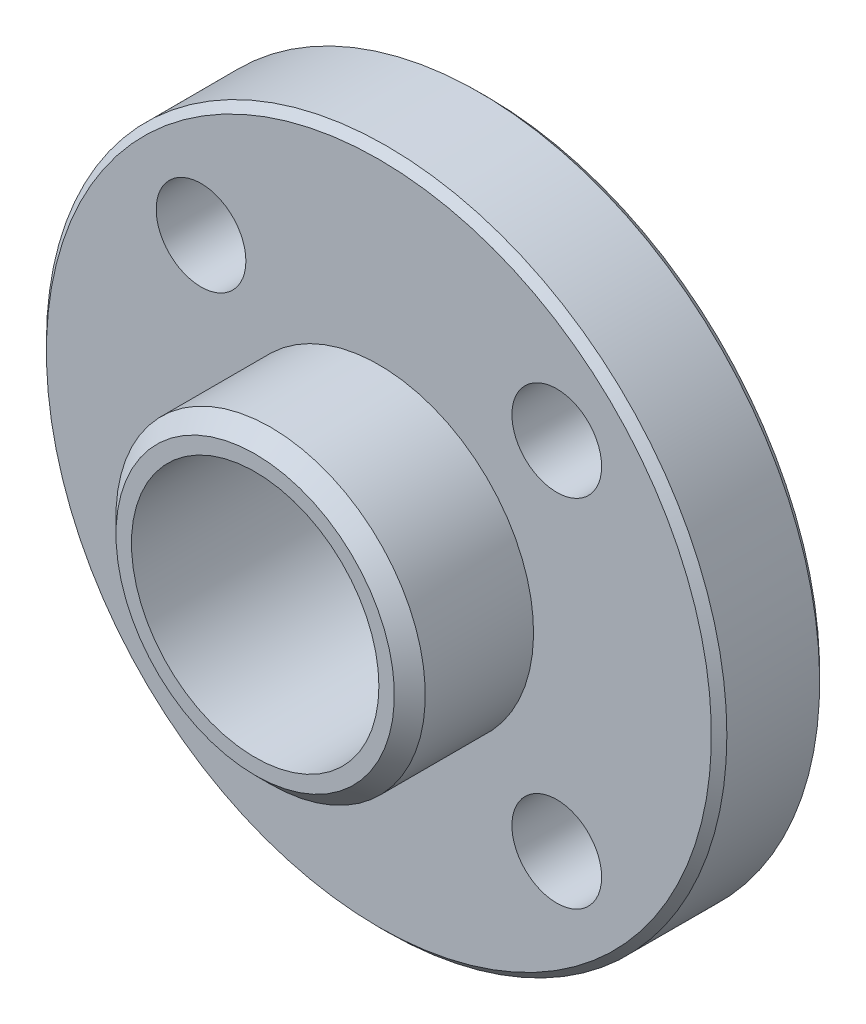
ISO-10303-21;
HEADER;
FILE_DESCRIPTION(('STEP AP214'),'2;1');
FILE_NAME('part.step','',(''),(''),'','','');
FILE_SCHEMA(('AUTOMOTIVE_DESIGN { 1 0 10303 214 1 1 1 1 }'));
ENDSEC;
DATA;
#1=APPLICATION_CONTEXT('core data for automotive mechanical design processes');
#2=APPLICATION_PROTOCOL_DEFINITION('international standard','automotive_design',2000,#1);
#3=PRODUCT_CONTEXT('',#1,'mechanical');
#4=PRODUCT('Part','Part','',(#3));
#5=PRODUCT_RELATED_PRODUCT_CATEGORY('part','',(#4));
#6=PRODUCT_DEFINITION_FORMATION('','',#4);
#7=PRODUCT_DEFINITION_CONTEXT('part definition',#1,'design');
#8=PRODUCT_DEFINITION('design','',#6,#7);
#9=PRODUCT_DEFINITION_SHAPE('','',#8);
#10=(LENGTH_UNIT() NAMED_UNIT(*) SI_UNIT(.MILLI.,.METRE.));
#11=(NAMED_UNIT(*) PLANE_ANGLE_UNIT() SI_UNIT($,.RADIAN.));
#12=(NAMED_UNIT(*) SI_UNIT($,.STERADIAN.) SOLID_ANGLE_UNIT());
#13=UNCERTAINTY_MEASURE_WITH_UNIT(LENGTH_MEASURE(1.E-05),#10,'distance_accuracy_value','');
#14=(GEOMETRIC_REPRESENTATION_CONTEXT(3) GLOBAL_UNCERTAINTY_ASSIGNED_CONTEXT((#13)) GLOBAL_UNIT_ASSIGNED_CONTEXT((#10,
#11,#12)) REPRESENTATION_CONTEXT('',''));
#15=CARTESIAN_POINT('',(0.,0.,0.));
#16=DIRECTION('',(0.,0.,1.));
#17=DIRECTION('',(1.,0.,0.));
#18=AXIS2_PLACEMENT_3D('',#15,#16,#17);
#19=CARTESIAN_POINT('',(0.,0.,5.75));
#20=DIRECTION('',(0.,0.,-1.));
#21=DIRECTION('',(0.,1.,0.));
#22=AXIS2_PLACEMENT_3D('',#19,#20,#21);
#23=PLANE('',#22);
#24=CARTESIAN_POINT('',(0.,0.,5.75));
#25=DIRECTION('',(0.,0.,-1.));
#26=DIRECTION('',(0.,1.,0.));
#27=AXIS2_PLACEMENT_3D('',#24,#25,#26);
#28=CIRCLE('',#27,4.5);
#29=CARTESIAN_POINT('',(0.,4.5,5.75));
#30=VERTEX_POINT('',#29);
#31=EDGE_CURVE('E95',#30,#30,#28,.F.);
#32=ORIENTED_EDGE('',*,*,#31,.T.);
#33=EDGE_LOOP('',(#32));
#34=FACE_BOUND('',#33,.T.);
#35=CARTESIAN_POINT('',(0.,0.,5.75));
#36=DIRECTION('',(0.,0.,1.));
#37=DIRECTION('',(1.,0.,0.));
#38=AXIS2_PLACEMENT_3D('',#35,#36,#37);
#39=CIRCLE('',#38,4.);
#40=CARTESIAN_POINT('',(4.,0.,5.75));
#41=VERTEX_POINT('',#40);
#42=EDGE_CURVE('E77',#41,#41,#39,.T.);
#43=ORIENTED_EDGE('',*,*,#42,.F.);
#44=EDGE_LOOP('',(#43));
#45=FACE_BOUND('',#44,.T.);
#46=ADVANCED_FACE('F36',(#34,#45),#23,.F.);
#47=CARTESIAN_POINT('',(0.,0.,5.75));
#48=DIRECTION('',(0.,0.,1.));
#49=DIRECTION('',(0.,-1.,0.));
#50=AXIS2_PLACEMENT_3D('',#47,#48,#49);
#51=CYLINDRICAL_SURFACE('',#50,5.);
#52=CARTESIAN_POINT('',(0.,0.,5.25));
#53=DIRECTION('',(0.,0.,-1.));
#54=DIRECTION('',(0.,1.,0.));
#55=AXIS2_PLACEMENT_3D('',#52,#53,#54);
#56=CIRCLE('',#55,5.);
#57=CARTESIAN_POINT('',(0.,5.,5.25));
#58=VERTEX_POINT('',#57);
#59=EDGE_CURVE('E98',#58,#58,#56,.T.);
#60=ORIENTED_EDGE('',*,*,#59,.T.);
#61=EDGE_LOOP('',(#60));
#62=FACE_BOUND('',#61,.T.);
#63=CARTESIAN_POINT('',(0.,0.,1.75));
#64=DIRECTION('',(0.,0.,1.));
#65=DIRECTION('',(0.,-1.,0.));
#66=AXIS2_PLACEMENT_3D('',#63,#64,#65);
#67=CIRCLE('',#66,5.);
#68=CARTESIAN_POINT('',(0.,-5.,1.75));
#69=VERTEX_POINT('',#68);
#70=EDGE_CURVE('E86',#69,#69,#67,.T.);
#71=ORIENTED_EDGE('',*,*,#70,.T.);
#72=EDGE_LOOP('',(#71));
#73=FACE_BOUND('',#72,.T.);
#74=ADVANCED_FACE('F122',(#62,#73),#51,.T.);
#75=CARTESIAN_POINT('',(0.,5.,1.75));
#76=DIRECTION('',(0.,0.,-1.));
#77=DIRECTION('',(0.,1.,0.));
#78=AXIS2_PLACEMENT_3D('',#75,#76,#77);
#79=PLANE('',#78);
#80=CARTESIAN_POINT('',(-5.75,5.75,1.75));
#81=DIRECTION('',(0.,0.,1.));
#82=DIRECTION('',(1.,0.,0.));
#83=AXIS2_PLACEMENT_3D('',#80,#81,#82);
#84=CIRCLE('',#83,1.45);
#85=CARTESIAN_POINT('',(-4.3,5.75,1.75));
#86=VERTEX_POINT('',#85);
#87=EDGE_CURVE('E69',#86,#86,#84,.T.);
#88=ORIENTED_EDGE('',*,*,#87,.F.);
#89=EDGE_LOOP('',(#88));
#90=FACE_BOUND('',#89,.T.);
#91=CARTESIAN_POINT('',(5.75,5.75,1.75));
#92=DIRECTION('',(0.,0.,1.));
#93=DIRECTION('',(1.,0.,0.));
#94=AXIS2_PLACEMENT_3D('',#91,#92,#93);
#95=CIRCLE('',#94,1.45);
#96=CARTESIAN_POINT('',(7.2,5.75,1.75));
#97=VERTEX_POINT('',#96);
#98=EDGE_CURVE('E59',#97,#97,#95,.T.);
#99=ORIENTED_EDGE('',*,*,#98,.F.);
#100=EDGE_LOOP('',(#99));
#101=FACE_BOUND('',#100,.T.);
#102=CARTESIAN_POINT('',(5.75,-5.75,1.75));
#103=DIRECTION('',(0.,0.,1.));
#104=DIRECTION('',(1.,0.,0.));
#105=AXIS2_PLACEMENT_3D('',#102,#103,#104);
#106=CIRCLE('',#105,1.45);
#107=CARTESIAN_POINT('',(7.2,-5.75,1.75));
#108=VERTEX_POINT('',#107);
#109=EDGE_CURVE('E56',#108,#108,#106,.T.);
#110=ORIENTED_EDGE('',*,*,#109,.F.);
#111=EDGE_LOOP('',(#110));
#112=FACE_BOUND('',#111,.T.);
#113=CARTESIAN_POINT('',(-5.75,-5.75,1.75));
#114=DIRECTION('',(0.,0.,1.));
#115=DIRECTION('',(1.,0.,0.));
#116=AXIS2_PLACEMENT_3D('',#113,#114,#115);
#117=CIRCLE('',#116,1.45);
#118=CARTESIAN_POINT('',(-4.3,-5.75,1.75));
#119=VERTEX_POINT('',#118);
#120=EDGE_CURVE('E55',#119,#119,#117,.T.);
#121=ORIENTED_EDGE('',*,*,#120,.F.);
#122=EDGE_LOOP('',(#121));
#123=FACE_BOUND('',#122,.T.);
#124=CARTESIAN_POINT('',(0.,0.,1.75));
#125=DIRECTION('',(0.,0.,-1.));
#126=DIRECTION('',(0.,1.,0.));
#127=AXIS2_PLACEMENT_3D('',#124,#125,#126);
#128=CIRCLE('',#127,10.75);
#129=CARTESIAN_POINT('',(0.,10.75,1.75));
#130=VERTEX_POINT('',#129);
#131=EDGE_CURVE('E101',#130,#130,#128,.F.);
#132=ORIENTED_EDGE('',*,*,#131,.T.);
#133=EDGE_LOOP('',(#132));
#134=FACE_BOUND('',#133,.T.);
#135=ORIENTED_EDGE('',*,*,#70,.F.);
#136=EDGE_LOOP('',(#135));
#137=FACE_BOUND('',#136,.T.);
#138=ADVANCED_FACE('F128',(#90,#101,#112,#123,#134,#137),#79,.F.);
#139=CARTESIAN_POINT('',(0.,0.,5.75));
#140=DIRECTION('',(0.,0.,1.));
#141=DIRECTION('',(0.,-1.,0.));
#142=AXIS2_PLACEMENT_3D('',#139,#140,#141);
#143=CYLINDRICAL_SURFACE('',#142,11.);
#144=CARTESIAN_POINT('',(0.,0.,1.49999999999999));
#145=DIRECTION('',(0.,0.,-1.));
#146=DIRECTION('',(0.,1.,0.));
#147=AXIS2_PLACEMENT_3D('',#144,#145,#146);
#148=CIRCLE('',#147,11.);
#149=CARTESIAN_POINT('',(0.,11.,1.5));
#150=VERTEX_POINT('',#149);
#151=EDGE_CURVE('E44',#150,#150,#148,.T.);
#152=ORIENTED_EDGE('',*,*,#151,.T.);
#153=EDGE_LOOP('',(#152));
#154=FACE_BOUND('',#153,.T.);
#155=CARTESIAN_POINT('',(0.,0.,-1.50000000000001));
#156=DIRECTION('',(0.,0.,1.));
#157=DIRECTION('',(0.,-1.,0.));
#158=AXIS2_PLACEMENT_3D('',#155,#156,#157);
#159=CIRCLE('',#158,11.);
#160=CARTESIAN_POINT('',(0.,-11.,-1.50000000000001));
#161=VERTEX_POINT('',#160);
#162=EDGE_CURVE('E49',#161,#161,#159,.T.);
#163=ORIENTED_EDGE('',*,*,#162,.T.);
#164=EDGE_LOOP('',(#163));
#165=FACE_BOUND('',#164,.T.);
#166=ADVANCED_FACE('F106',(#154,#165),#143,.T.);
#167=CARTESIAN_POINT('',(0.,11.,-1.75));
#168=DIRECTION('',(0.,0.,1.));
#169=DIRECTION('',(0.,-1.,0.));
#170=AXIS2_PLACEMENT_3D('',#167,#168,#169);
#171=PLANE('',#170);
#172=CARTESIAN_POINT('',(-5.75,5.75,-1.75));
#173=DIRECTION('',(0.,0.,1.));
#174=DIRECTION('',(0.,-1.,0.));
#175=AXIS2_PLACEMENT_3D('',#172,#173,#174);
#176=CIRCLE('',#175,1.45);
#177=CARTESIAN_POINT('',(-5.75,4.3,-1.75));
#178=VERTEX_POINT('',#177);
#179=EDGE_CURVE('E40',#178,#178,#176,.T.);
#180=ORIENTED_EDGE('',*,*,#179,.T.);
#181=EDGE_LOOP('',(#180));
#182=FACE_BOUND('',#181,.T.);
#183=CARTESIAN_POINT('',(5.75,5.75,-1.75));
#184=DIRECTION('',(0.,0.,1.));
#185=DIRECTION('',(0.,-1.,0.));
#186=AXIS2_PLACEMENT_3D('',#183,#184,#185);
#187=CIRCLE('',#186,1.45);
#188=CARTESIAN_POINT('',(5.75,4.3,-1.75));
#189=VERTEX_POINT('',#188);
#190=EDGE_CURVE('E57',#189,#189,#187,.T.);
#191=ORIENTED_EDGE('',*,*,#190,.T.);
#192=EDGE_LOOP('',(#191));
#193=FACE_BOUND('',#192,.T.);
#194=CARTESIAN_POINT('',(5.75,-5.75,-1.75));
#195=DIRECTION('',(0.,0.,1.));
#196=DIRECTION('',(0.,-1.,0.));
#197=AXIS2_PLACEMENT_3D('',#194,#195,#196);
#198=CIRCLE('',#197,1.45);
#199=CARTESIAN_POINT('',(5.75,-7.2,-1.75));
#200=VERTEX_POINT('',#199);
#201=EDGE_CURVE('E53',#200,#200,#198,.T.);
#202=ORIENTED_EDGE('',*,*,#201,.T.);
#203=EDGE_LOOP('',(#202));
#204=FACE_BOUND('',#203,.T.);
#205=CARTESIAN_POINT('',(-5.75,-5.75,-1.75));
#206=DIRECTION('',(0.,0.,1.));
#207=DIRECTION('',(0.,-1.,0.));
#208=AXIS2_PLACEMENT_3D('',#205,#206,#207);
#209=CIRCLE('',#208,1.45);
#210=CARTESIAN_POINT('',(-5.75,-7.2,-1.75));
#211=VERTEX_POINT('',#210);
#212=EDGE_CURVE('E74',#211,#211,#209,.T.);
#213=ORIENTED_EDGE('',*,*,#212,.T.);
#214=EDGE_LOOP('',(#213));
#215=FACE_BOUND('',#214,.T.);
#216=CARTESIAN_POINT('',(0.,0.,-1.75));
#217=DIRECTION('',(0.,0.,1.));
#218=DIRECTION('',(0.,-1.,0.));
#219=AXIS2_PLACEMENT_3D('',#216,#217,#218);
#220=CIRCLE('',#219,10.75);
#221=CARTESIAN_POINT('',(0.,-10.75,-1.75));
#222=VERTEX_POINT('',#221);
#223=EDGE_CURVE('E10',#222,#222,#220,.F.);
#224=ORIENTED_EDGE('',*,*,#223,.T.);
#225=EDGE_LOOP('',(#224));
#226=FACE_BOUND('',#225,.T.);
#227=CARTESIAN_POINT('',(0.,0.,-1.75));
#228=DIRECTION('',(0.,0.,1.));
#229=DIRECTION('',(0.,-1.,0.));
#230=AXIS2_PLACEMENT_3D('',#227,#228,#229);
#231=CIRCLE('',#230,5.);
#232=CARTESIAN_POINT('',(0.,-5.,-1.75));
#233=VERTEX_POINT('',#232);
#234=EDGE_CURVE('E81',#233,#233,#231,.T.);
#235=ORIENTED_EDGE('',*,*,#234,.T.);
#236=EDGE_LOOP('',(#235));
#237=FACE_BOUND('',#236,.T.);
#238=ADVANCED_FACE('F154',(#182,#193,#204,#215,#226,#237),#171,.F.);
#239=CARTESIAN_POINT('',(0.,0.,5.75));
#240=DIRECTION('',(0.,0.,1.));
#241=DIRECTION('',(0.,-1.,0.));
#242=AXIS2_PLACEMENT_3D('',#239,#240,#241);
#243=CYLINDRICAL_SURFACE('',#242,5.);
#244=CARTESIAN_POINT('',(0.,0.,-5.25000000000001));
#245=DIRECTION('',(0.,0.,1.));
#246=DIRECTION('',(0.,-1.,0.));
#247=AXIS2_PLACEMENT_3D('',#244,#245,#246);
#248=CIRCLE('',#247,5.);
#249=CARTESIAN_POINT('',(0.,-5.,-5.25000000000001));
#250=VERTEX_POINT('',#249);
#251=EDGE_CURVE('E89',#250,#250,#248,.T.);
#252=ORIENTED_EDGE('',*,*,#251,.T.);
#253=EDGE_LOOP('',(#252));
#254=FACE_BOUND('',#253,.T.);
#255=ORIENTED_EDGE('',*,*,#234,.F.);
#256=EDGE_LOOP('',(#255));
#257=FACE_BOUND('',#256,.T.);
#258=ADVANCED_FACE('F162',(#254,#257),#243,.T.);
#259=CARTESIAN_POINT('',(0.,5.,-5.75));
#260=DIRECTION('',(0.,0.,1.));
#261=DIRECTION('',(0.,-1.,0.));
#262=AXIS2_PLACEMENT_3D('',#259,#260,#261);
#263=PLANE('',#262);
#264=CARTESIAN_POINT('',(0.,0.,-5.75));
#265=DIRECTION('',(0.,0.,1.));
#266=DIRECTION('',(0.,-1.,0.));
#267=AXIS2_PLACEMENT_3D('',#264,#265,#266);
#268=CIRCLE('',#267,4.5);
#269=CARTESIAN_POINT('',(0.,-4.5,-5.75));
#270=VERTEX_POINT('',#269);
#271=EDGE_CURVE('E92',#270,#270,#268,.F.);
#272=ORIENTED_EDGE('',*,*,#271,.T.);
#273=EDGE_LOOP('',(#272));
#274=FACE_BOUND('',#273,.T.);
#275=CARTESIAN_POINT('',(0.,0.,-5.75));
#276=DIRECTION('',(0.,0.,1.));
#277=DIRECTION('',(1.,0.,0.));
#278=AXIS2_PLACEMENT_3D('',#275,#276,#277);
#279=CIRCLE('',#278,4.);
#280=CARTESIAN_POINT('',(4.,0.,-5.75));
#281=VERTEX_POINT('',#280);
#282=EDGE_CURVE('E78',#281,#281,#279,.T.);
#283=ORIENTED_EDGE('',*,*,#282,.T.);
#284=EDGE_LOOP('',(#283));
#285=FACE_BOUND('',#284,.T.);
#286=ADVANCED_FACE('F166',(#274,#285),#263,.F.);
#287=CARTESIAN_POINT('',(0.,0.,-5.75));
#288=DIRECTION('',(0.,0.,1.));
#289=DIRECTION('',(1.,0.,0.));
#290=AXIS2_PLACEMENT_3D('',#287,#288,#289);
#291=CYLINDRICAL_SURFACE('',#290,4.);
#292=ORIENTED_EDGE('',*,*,#282,.F.);
#293=EDGE_LOOP('',(#292));
#294=FACE_BOUND('',#293,.T.);
#295=ORIENTED_EDGE('',*,*,#42,.T.);
#296=EDGE_LOOP('',(#295));
#297=FACE_BOUND('',#296,.T.);
#298=ADVANCED_FACE('F137',(#294,#297),#291,.F.);
#299=CARTESIAN_POINT('',(0.,0.,-5.25000000000001));
#300=DIRECTION('',(0.,0.,1.));
#301=DIRECTION('',(0.,-1.,0.));
#302=AXIS2_PLACEMENT_3D('',#299,#300,#301);
#303=CONICAL_SURFACE('',#302,5.,0.785398163397452);
#304=ORIENTED_EDGE('',*,*,#271,.F.);
#305=EDGE_LOOP('',(#304));
#306=FACE_BOUND('',#305,.T.);
#307=ORIENTED_EDGE('',*,*,#251,.F.);
#308=EDGE_LOOP('',(#307));
#309=FACE_BOUND('',#308,.T.);
#310=ADVANCED_FACE('F134',(#306,#309),#303,.T.);
#311=CARTESIAN_POINT('',(0.,0.,5.75));
#312=DIRECTION('',(0.,0.,-1.));
#313=DIRECTION('',(0.,1.,0.));
#314=AXIS2_PLACEMENT_3D('',#311,#312,#313);
#315=CONICAL_SURFACE('',#314,4.5,0.785398163397448);
#316=ORIENTED_EDGE('',*,*,#59,.F.);
#317=EDGE_LOOP('',(#316));
#318=FACE_BOUND('',#317,.T.);
#319=ORIENTED_EDGE('',*,*,#31,.F.);
#320=EDGE_LOOP('',(#319));
#321=FACE_BOUND('',#320,.T.);
#322=ADVANCED_FACE('F119',(#318,#321),#315,.T.);
#323=CARTESIAN_POINT('',(0.,0.,1.75));
#324=DIRECTION('',(0.,0.,-1.));
#325=DIRECTION('',(0.,1.,0.));
#326=AXIS2_PLACEMENT_3D('',#323,#324,#325);
#327=CONICAL_SURFACE('',#326,10.75,0.785398163397455);
#328=ORIENTED_EDGE('',*,*,#151,.F.);
#329=EDGE_LOOP('',(#328));
#330=FACE_BOUND('',#329,.T.);
#331=ORIENTED_EDGE('',*,*,#131,.F.);
#332=EDGE_LOOP('',(#331));
#333=FACE_BOUND('',#332,.T.);
#334=ADVANCED_FACE('F110',(#330,#333),#327,.T.);
#335=CARTESIAN_POINT('',(0.,0.,-1.50000000000001));
#336=DIRECTION('',(0.,0.,1.));
#337=DIRECTION('',(0.,-1.,0.));
#338=AXIS2_PLACEMENT_3D('',#335,#336,#337);
#339=CONICAL_SURFACE('',#338,11.,0.785398163397452);
#340=ORIENTED_EDGE('',*,*,#223,.F.);
#341=EDGE_LOOP('',(#340));
#342=FACE_BOUND('',#341,.T.);
#343=ORIENTED_EDGE('',*,*,#162,.F.);
#344=EDGE_LOOP('',(#343));
#345=FACE_BOUND('',#344,.T.);
#346=ADVANCED_FACE('F38',(#342,#345),#339,.T.);
#347=CARTESIAN_POINT('',(-5.75,-5.75,1.75));
#348=DIRECTION('',(0.,0.,1.));
#349=DIRECTION('',(1.,0.,0.));
#350=AXIS2_PLACEMENT_3D('',#347,#348,#349);
#351=CYLINDRICAL_SURFACE('',#350,1.45);
#352=ORIENTED_EDGE('',*,*,#120,.T.);
#353=EDGE_LOOP('',(#352));
#354=FACE_BOUND('',#353,.T.);
#355=ORIENTED_EDGE('',*,*,#212,.F.);
#356=EDGE_LOOP('',(#355));
#357=FACE_BOUND('',#356,.T.);
#358=ADVANCED_FACE('F109',(#354,#357),#351,.F.);
#359=CARTESIAN_POINT('',(5.75,-5.75,1.75));
#360=DIRECTION('',(0.,0.,1.));
#361=DIRECTION('',(1.,0.,0.));
#362=AXIS2_PLACEMENT_3D('',#359,#360,#361);
#363=CYLINDRICAL_SURFACE('',#362,1.45);
#364=ORIENTED_EDGE('',*,*,#109,.T.);
#365=EDGE_LOOP('',(#364));
#366=FACE_BOUND('',#365,.T.);
#367=ORIENTED_EDGE('',*,*,#201,.F.);
#368=EDGE_LOOP('',(#367));
#369=FACE_BOUND('',#368,.T.);
#370=ADVANCED_FACE('F116',(#366,#369),#363,.F.);
#371=CARTESIAN_POINT('',(5.75,5.75,1.75));
#372=DIRECTION('',(0.,0.,1.));
#373=DIRECTION('',(1.,0.,0.));
#374=AXIS2_PLACEMENT_3D('',#371,#372,#373);
#375=CYLINDRICAL_SURFACE('',#374,1.45);
#376=ORIENTED_EDGE('',*,*,#98,.T.);
#377=EDGE_LOOP('',(#376));
#378=FACE_BOUND('',#377,.T.);
#379=ORIENTED_EDGE('',*,*,#190,.F.);
#380=EDGE_LOOP('',(#379));
#381=FACE_BOUND('',#380,.T.);
#382=ADVANCED_FACE('F176',(#378,#381),#375,.F.);
#383=CARTESIAN_POINT('',(-5.75,5.75,1.75));
#384=DIRECTION('',(0.,0.,1.));
#385=DIRECTION('',(1.,0.,0.));
#386=AXIS2_PLACEMENT_3D('',#383,#384,#385);
#387=CYLINDRICAL_SURFACE('',#386,1.45);
#388=ORIENTED_EDGE('',*,*,#87,.T.);
#389=EDGE_LOOP('',(#388));
#390=FACE_BOUND('',#389,.T.);
#391=ORIENTED_EDGE('',*,*,#179,.F.);
#392=EDGE_LOOP('',(#391));
#393=FACE_BOUND('',#392,.T.);
#394=ADVANCED_FACE('F180',(#390,#393),#387,.F.);
#395=CLOSED_SHELL('',(#46,#74,#138,#166,#238,#258,#286,#298,#310,#322,#334,#346,#358,#370,#382,#394));
#396=MANIFOLD_SOLID_BREP('B2',#395);
#397=ADVANCED_BREP_SHAPE_REPRESENTATION('',(#18,#396),#14);
#398=SHAPE_DEFINITION_REPRESENTATION(#9,#397);
ENDSEC;
END-ISO-10303-21;
